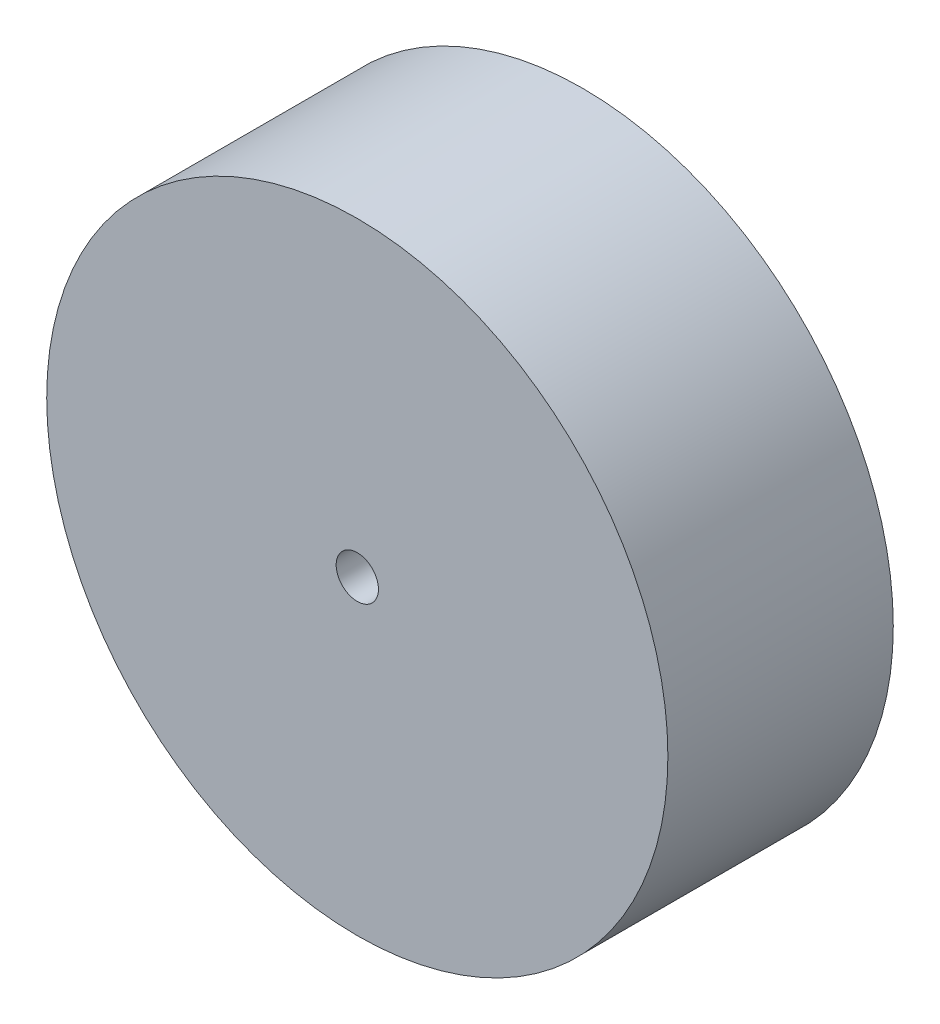
ISO-10303-21;
HEADER;
FILE_DESCRIPTION(('STEP AP214'),'2;1');
FILE_NAME('part.step','',(''),(''),'','','');
FILE_SCHEMA(('AUTOMOTIVE_DESIGN { 1 0 10303 214 1 1 1 1 }'));
ENDSEC;
DATA;
#1=APPLICATION_CONTEXT('core data for automotive mechanical design processes');
#2=APPLICATION_PROTOCOL_DEFINITION('international standard','automotive_design',2000,#1);
#3=PRODUCT_CONTEXT('',#1,'mechanical');
#4=PRODUCT('Part','Part','',(#3));
#5=PRODUCT_RELATED_PRODUCT_CATEGORY('part','',(#4));
#6=PRODUCT_DEFINITION_FORMATION('','',#4);
#7=PRODUCT_DEFINITION_CONTEXT('part definition',#1,'design');
#8=PRODUCT_DEFINITION('design','',#6,#7);
#9=PRODUCT_DEFINITION_SHAPE('','',#8);
#10=(LENGTH_UNIT() NAMED_UNIT(*) SI_UNIT(.MILLI.,.METRE.));
#11=(NAMED_UNIT(*) PLANE_ANGLE_UNIT() SI_UNIT($,.RADIAN.));
#12=(NAMED_UNIT(*) SI_UNIT($,.STERADIAN.) SOLID_ANGLE_UNIT());
#13=UNCERTAINTY_MEASURE_WITH_UNIT(LENGTH_MEASURE(1.E-05),#10,'distance_accuracy_value','');
#14=(GEOMETRIC_REPRESENTATION_CONTEXT(3) GLOBAL_UNCERTAINTY_ASSIGNED_CONTEXT((#13)) GLOBAL_UNIT_ASSIGNED_CONTEXT((#10,
#11,#12)) REPRESENTATION_CONTEXT('',''));
#15=CARTESIAN_POINT('',(0.,0.,0.));
#16=DIRECTION('',(0.,0.,1.));
#17=DIRECTION('',(1.,0.,0.));
#18=AXIS2_PLACEMENT_3D('',#15,#16,#17);
#19=CARTESIAN_POINT('',(0.,0.,25.4));
#20=DIRECTION('',(0.,0.,1.));
#21=DIRECTION('',(1.,0.,0.));
#22=AXIS2_PLACEMENT_3D('',#19,#20,#21);
#23=PLANE('',#22);
#24=CARTESIAN_POINT('',(0.,0.,25.4));
#25=DIRECTION('',(0.,0.,1.));
#26=DIRECTION('',(1.,0.,0.));
#27=AXIS2_PLACEMENT_3D('',#24,#25,#26);
#28=CIRCLE('',#27,35.000057);
#29=CARTESIAN_POINT('',(35.000057,0.,25.4));
#30=VERTEX_POINT('',#29);
#31=EDGE_CURVE('E10',#30,#30,#28,.T.);
#32=ORIENTED_EDGE('',*,*,#31,.T.);
#33=EDGE_LOOP('',(#32));
#34=FACE_BOUND('',#33,.T.);
#35=CARTESIAN_POINT('',(0.,0.,25.4));
#36=DIRECTION('',(0.,0.,1.));
#37=DIRECTION('',(1.,0.,0.));
#38=AXIS2_PLACEMENT_3D('',#35,#36,#37);
#39=CIRCLE('',#38,2.38125);
#40=CARTESIAN_POINT('',(2.38125,0.,25.4));
#41=VERTEX_POINT('',#40);
#42=EDGE_CURVE('E41',#41,#41,#39,.T.);
#43=ORIENTED_EDGE('',*,*,#42,.F.);
#44=EDGE_LOOP('',(#43));
#45=FACE_BOUND('',#44,.T.);
#46=ADVANCED_FACE('F30',(#34,#45),#23,.T.);
#47=CARTESIAN_POINT('',(0.,0.,0.));
#48=DIRECTION('',(0.,0.,1.));
#49=DIRECTION('',(1.,0.,0.));
#50=AXIS2_PLACEMENT_3D('',#47,#48,#49);
#51=PLANE('',#50);
#52=CARTESIAN_POINT('',(0.,0.,0.));
#53=DIRECTION('',(0.,0.,1.));
#54=DIRECTION('',(1.,0.,0.));
#55=AXIS2_PLACEMENT_3D('',#52,#53,#54);
#56=CIRCLE('',#55,35.000057);
#57=CARTESIAN_POINT('',(35.000057,0.,0.));
#58=VERTEX_POINT('',#57);
#59=EDGE_CURVE('E34',#58,#58,#56,.T.);
#60=ORIENTED_EDGE('',*,*,#59,.F.);
#61=EDGE_LOOP('',(#60));
#62=FACE_BOUND('',#61,.T.);
#63=CARTESIAN_POINT('',(0.,0.,0.));
#64=DIRECTION('',(0.,0.,1.));
#65=DIRECTION('',(1.,0.,0.));
#66=AXIS2_PLACEMENT_3D('',#63,#64,#65);
#67=CIRCLE('',#66,2.38125);
#68=CARTESIAN_POINT('',(2.38125,0.,0.));
#69=VERTEX_POINT('',#68);
#70=EDGE_CURVE('E43',#69,#69,#67,.T.);
#71=ORIENTED_EDGE('',*,*,#70,.T.);
#72=EDGE_LOOP('',(#71));
#73=FACE_BOUND('',#72,.T.);
#74=ADVANCED_FACE('F53',(#62,#73),#51,.F.);
#75=CARTESIAN_POINT('',(0.,0.,25.4));
#76=DIRECTION('',(0.,0.,-1.));
#77=DIRECTION('',(-1.,0.,0.));
#78=AXIS2_PLACEMENT_3D('',#75,#76,#77);
#79=CYLINDRICAL_SURFACE('',#78,35.000057);
#80=ORIENTED_EDGE('',*,*,#31,.F.);
#81=EDGE_LOOP('',(#80));
#82=FACE_BOUND('',#81,.T.);
#83=ORIENTED_EDGE('',*,*,#59,.T.);
#84=EDGE_LOOP('',(#83));
#85=FACE_BOUND('',#84,.T.);
#86=ADVANCED_FACE('F32',(#82,#85),#79,.T.);
#87=CARTESIAN_POINT('',(0.,0.,25.4));
#88=DIRECTION('',(0.,0.,-1.));
#89=DIRECTION('',(-1.,0.,0.));
#90=AXIS2_PLACEMENT_3D('',#87,#88,#89);
#91=CYLINDRICAL_SURFACE('',#90,2.38125);
#92=ORIENTED_EDGE('',*,*,#42,.T.);
#93=EDGE_LOOP('',(#92));
#94=FACE_BOUND('',#93,.T.);
#95=ORIENTED_EDGE('',*,*,#70,.F.);
#96=EDGE_LOOP('',(#95));
#97=FACE_BOUND('',#96,.T.);
#98=ADVANCED_FACE('F49',(#94,#97),#91,.F.);
#99=CLOSED_SHELL('',(#46,#74,#86,#98));
#100=MANIFOLD_SOLID_BREP('B2',#99);
#101=ADVANCED_BREP_SHAPE_REPRESENTATION('',(#18,#100),#14);
#102=SHAPE_DEFINITION_REPRESENTATION(#9,#101);
ENDSEC;
END-ISO-10303-21;
